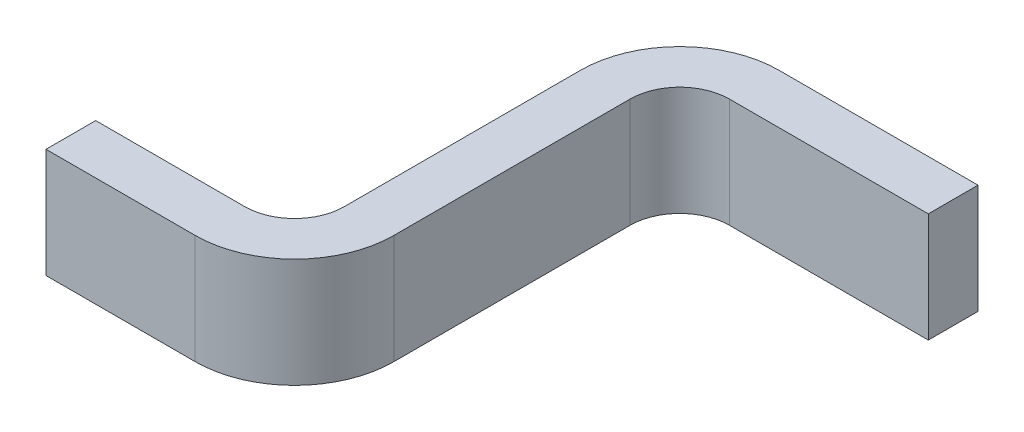
ISO-10303-21;
HEADER;
FILE_DESCRIPTION(('STEP AP214'),'2;1');
FILE_NAME('part.step','',(''),(''),'','','');
FILE_SCHEMA(('AUTOMOTIVE_DESIGN { 1 0 10303 214 1 1 1 1 }'));
ENDSEC;
DATA;
#1=APPLICATION_CONTEXT('core data for automotive mechanical design processes');
#2=APPLICATION_PROTOCOL_DEFINITION('international standard','automotive_design',2000,#1);
#3=PRODUCT_CONTEXT('',#1,'mechanical');
#4=PRODUCT('Part','Part','',(#3));
#5=PRODUCT_RELATED_PRODUCT_CATEGORY('part','',(#4));
#6=PRODUCT_DEFINITION_FORMATION('','',#4);
#7=PRODUCT_DEFINITION_CONTEXT('part definition',#1,'design');
#8=PRODUCT_DEFINITION('design','',#6,#7);
#9=PRODUCT_DEFINITION_SHAPE('','',#8);
#10=(LENGTH_UNIT() NAMED_UNIT(*) SI_UNIT(.MILLI.,.METRE.));
#11=(NAMED_UNIT(*) PLANE_ANGLE_UNIT() SI_UNIT($,.RADIAN.));
#12=(NAMED_UNIT(*) SI_UNIT($,.STERADIAN.) SOLID_ANGLE_UNIT());
#13=UNCERTAINTY_MEASURE_WITH_UNIT(LENGTH_MEASURE(1.E-05),#10,'distance_accuracy_value','');
#14=(GEOMETRIC_REPRESENTATION_CONTEXT(3) GLOBAL_UNCERTAINTY_ASSIGNED_CONTEXT((#13)) GLOBAL_UNIT_ASSIGNED_CONTEXT((#10,
#11,#12)) REPRESENTATION_CONTEXT('',''));
#15=CARTESIAN_POINT('',(0.,0.,0.));
#16=DIRECTION('',(0.,0.,1.));
#17=DIRECTION('',(1.,0.,0.));
#18=AXIS2_PLACEMENT_3D('',#15,#16,#17);
#19=CARTESIAN_POINT('',(3.9,1.36,0.675));
#20=DIRECTION('',(0.,-1.,0.));
#21=DIRECTION('',(0.,0.,-1.));
#22=AXIS2_PLACEMENT_3D('',#19,#20,#21);
#23=PLANE('',#22);
#24=CARTESIAN_POINT('',(3.8,1.36,0.675));
#25=DIRECTION('',(0.,-1.,0.));
#26=DIRECTION('',(0.,0.,-1.));
#27=AXIS2_PLACEMENT_3D('',#24,#25,#26);
#28=CIRCLE('',#27,0.1);
#29=CARTESIAN_POINT('',(3.9,1.36,0.675));
#30=VERTEX_POINT('',#29);
#31=CARTESIAN_POINT('',(3.8,1.36,0.775));
#32=VERTEX_POINT('',#31);
#33=EDGE_CURVE('E162',#30,#32,#28,.T.);
#34=ORIENTED_EDGE('',*,*,#33,.T.);
#35=DIRECTION('',(1.,0.,0.));
#36=VECTOR('',#35,1.);
#37=CARTESIAN_POINT('',(3.5,1.36,0.775));
#38=LINE('',#37,#36);
#39=CARTESIAN_POINT('',(3.5,1.36,0.775));
#40=VERTEX_POINT('',#39);
#41=EDGE_CURVE('E120',#32,#40,#38,.F.);
#42=ORIENTED_EDGE('',*,*,#41,.T.);
#43=DIRECTION('',(0.,0.,1.));
#44=VECTOR('',#43,1.);
#45=CARTESIAN_POINT('',(3.5,1.36,0.775));
#46=LINE('',#45,#44);
#47=CARTESIAN_POINT('',(3.5,1.36,0.875));
#48=VERTEX_POINT('',#47);
#49=EDGE_CURVE('E116',#48,#40,#46,.F.);
#50=ORIENTED_EDGE('',*,*,#49,.F.);
#51=DIRECTION('',(-1.,0.,0.));
#52=VECTOR('',#51,1.);
#53=CARTESIAN_POINT('',(3.5,1.36,0.875));
#54=LINE('',#53,#52);
#55=CARTESIAN_POINT('',(3.8,1.36,0.875));
#56=VERTEX_POINT('',#55);
#57=EDGE_CURVE('E111',#48,#56,#54,.F.);
#58=ORIENTED_EDGE('',*,*,#57,.T.);
#59=CARTESIAN_POINT('',(3.8,1.36,0.675));
#60=DIRECTION('',(0.,-1.,0.));
#61=DIRECTION('',(0.,0.,-1.));
#62=AXIS2_PLACEMENT_3D('',#59,#60,#61);
#63=CIRCLE('',#62,0.2);
#64=CARTESIAN_POINT('',(4.,1.36,0.675));
#65=VERTEX_POINT('',#64);
#66=EDGE_CURVE('E102',#65,#56,#63,.T.);
#67=ORIENTED_EDGE('',*,*,#66,.F.);
#68=DIRECTION('',(0.,0.,1.));
#69=VECTOR('',#68,1.);
#70=CARTESIAN_POINT('',(4.,1.36,0.675));
#71=LINE('',#70,#69);
#72=CARTESIAN_POINT('',(4.,1.36,0.2));
#73=VERTEX_POINT('',#72);
#74=EDGE_CURVE('E98',#65,#73,#71,.F.);
#75=ORIENTED_EDGE('',*,*,#74,.T.);
#76=CARTESIAN_POINT('',(4.1,1.36,0.2));
#77=DIRECTION('',(0.,1.,0.));
#78=DIRECTION('',(0.,0.,1.));
#79=AXIS2_PLACEMENT_3D('',#76,#77,#78);
#80=CIRCLE('',#79,0.1);
#81=CARTESIAN_POINT('',(4.1,1.36,0.1));
#82=VERTEX_POINT('',#81);
#83=EDGE_CURVE('E20',#73,#82,#80,.F.);
#84=ORIENTED_EDGE('',*,*,#83,.T.);
#85=DIRECTION('',(-1.,0.,0.));
#86=VECTOR('',#85,1.);
#87=CARTESIAN_POINT('',(4.1,1.36,0.1));
#88=LINE('',#87,#86);
#89=CARTESIAN_POINT('',(4.5,1.36,0.1));
#90=VERTEX_POINT('',#89);
#91=EDGE_CURVE('E145',#82,#90,#88,.F.);
#92=ORIENTED_EDGE('',*,*,#91,.T.);
#93=DIRECTION('',(0.,0.,1.));
#94=VECTOR('',#93,1.);
#95=CARTESIAN_POINT('',(4.5,1.36,0.));
#96=LINE('',#95,#94);
#97=CARTESIAN_POINT('',(4.5,1.36,0.));
#98=VERTEX_POINT('',#97);
#99=EDGE_CURVE('E139',#90,#98,#96,.F.);
#100=ORIENTED_EDGE('',*,*,#99,.T.);
#101=DIRECTION('',(1.,0.,0.));
#102=VECTOR('',#101,1.);
#103=CARTESIAN_POINT('',(4.1,1.36,0.));
#104=LINE('',#103,#102);
#105=CARTESIAN_POINT('',(4.1,1.36,0.));
#106=VERTEX_POINT('',#105);
#107=EDGE_CURVE('E132',#98,#106,#104,.F.);
#108=ORIENTED_EDGE('',*,*,#107,.T.);
#109=CARTESIAN_POINT('',(4.1,1.36,0.2));
#110=DIRECTION('',(0.,1.,0.));
#111=DIRECTION('',(0.,0.,1.));
#112=AXIS2_PLACEMENT_3D('',#109,#110,#111);
#113=CIRCLE('',#112,0.2);
#114=CARTESIAN_POINT('',(3.9,1.36,0.2));
#115=VERTEX_POINT('',#114);
#116=EDGE_CURVE('E135',#115,#106,#113,.F.);
#117=ORIENTED_EDGE('',*,*,#116,.F.);
#118=DIRECTION('',(0.,0.,-1.));
#119=VECTOR('',#118,1.);
#120=CARTESIAN_POINT('',(3.9,1.36,0.675));
#121=LINE('',#120,#119);
#122=EDGE_CURVE('E128',#115,#30,#121,.F.);
#123=ORIENTED_EDGE('',*,*,#122,.T.);
#124=EDGE_LOOP('',(#34,#42,#50,#58,#67,#75,#84,#92,#100,#108,#117,#123));
#125=FACE_BOUND('',#124,.T.);
#126=ADVANCED_FACE('F17',(#125),#23,.F.);
#127=CARTESIAN_POINT('',(4.1,1.36,0.2));
#128=DIRECTION('',(0.,1.,0.));
#129=DIRECTION('',(0.,0.,1.));
#130=AXIS2_PLACEMENT_3D('',#127,#128,#129);
#131=CYLINDRICAL_SURFACE('',#130,0.1);
#132=DIRECTION('',(0.,1.,0.));
#133=VECTOR('',#132,1.);
#134=CARTESIAN_POINT('',(4.,1.36,0.2));
#135=LINE('',#134,#133);
#136=CARTESIAN_POINT('',(4.,1.14,0.2));
#137=VERTEX_POINT('',#136);
#138=EDGE_CURVE('E91',#73,#137,#135,.F.);
#139=ORIENTED_EDGE('',*,*,#138,.T.);
#140=CARTESIAN_POINT('',(4.1,1.14,0.2));
#141=DIRECTION('',(0.,1.,0.));
#142=DIRECTION('',(0.,0.,1.));
#143=AXIS2_PLACEMENT_3D('',#140,#141,#142);
#144=CIRCLE('',#143,0.1);
#145=CARTESIAN_POINT('',(4.1,1.14,0.1));
#146=VERTEX_POINT('',#145);
#147=EDGE_CURVE('E103',#137,#146,#144,.F.);
#148=ORIENTED_EDGE('',*,*,#147,.T.);
#149=DIRECTION('',(0.,1.,0.));
#150=VECTOR('',#149,1.);
#151=CARTESIAN_POINT('',(4.1,1.36,0.1));
#152=LINE('',#151,#150);
#153=EDGE_CURVE('E92',#146,#82,#152,.T.);
#154=ORIENTED_EDGE('',*,*,#153,.T.);
#155=ORIENTED_EDGE('',*,*,#83,.F.);
#156=EDGE_LOOP('',(#139,#148,#154,#155));
#157=FACE_BOUND('',#156,.T.);
#158=ADVANCED_FACE('F89',(#157),#131,.F.);
#159=CARTESIAN_POINT('',(4.1,1.36,0.1));
#160=DIRECTION('',(0.,0.,-1.));
#161=DIRECTION('',(-1.,0.,0.));
#162=AXIS2_PLACEMENT_3D('',#159,#160,#161);
#163=PLANE('',#162);
#164=ORIENTED_EDGE('',*,*,#153,.F.);
#165=DIRECTION('',(1.,0.,0.));
#166=VECTOR('',#165,1.);
#167=CARTESIAN_POINT('',(4.,1.14,0.1));
#168=LINE('',#167,#166);
#169=CARTESIAN_POINT('',(4.5,1.14,0.1));
#170=VERTEX_POINT('',#169);
#171=EDGE_CURVE('E105',#146,#170,#168,.T.);
#172=ORIENTED_EDGE('',*,*,#171,.T.);
#173=DIRECTION('',(0.,1.,0.));
#174=VECTOR('',#173,1.);
#175=CARTESIAN_POINT('',(4.5,1.14,0.1));
#176=LINE('',#175,#174);
#177=EDGE_CURVE('E142',#170,#90,#176,.T.);
#178=ORIENTED_EDGE('',*,*,#177,.T.);
#179=ORIENTED_EDGE('',*,*,#91,.F.);
#180=EDGE_LOOP('',(#164,#172,#178,#179));
#181=FACE_BOUND('',#180,.T.);
#182=ADVANCED_FACE('F187',(#181),#163,.F.);
#183=CARTESIAN_POINT('',(4.5,1.14,0.));
#184=DIRECTION('',(-1.,0.,0.));
#185=DIRECTION('',(0.,0.,1.));
#186=AXIS2_PLACEMENT_3D('',#183,#184,#185);
#187=PLANE('',#186);
#188=ORIENTED_EDGE('',*,*,#177,.F.);
#189=DIRECTION('',(0.,0.,1.));
#190=VECTOR('',#189,1.);
#191=CARTESIAN_POINT('',(4.5,1.14,0.675));
#192=LINE('',#191,#190);
#193=CARTESIAN_POINT('',(4.5,1.14,0.));
#194=VERTEX_POINT('',#193);
#195=EDGE_CURVE('E176',#170,#194,#192,.F.);
#196=ORIENTED_EDGE('',*,*,#195,.T.);
#197=DIRECTION('',(0.,1.,0.));
#198=VECTOR('',#197,1.);
#199=CARTESIAN_POINT('',(4.5,1.14,0.));
#200=LINE('',#199,#198);
#201=EDGE_CURVE('E136',#194,#98,#200,.T.);
#202=ORIENTED_EDGE('',*,*,#201,.T.);
#203=ORIENTED_EDGE('',*,*,#99,.F.);
#204=EDGE_LOOP('',(#188,#196,#202,#203));
#205=FACE_BOUND('',#204,.T.);
#206=ADVANCED_FACE('F192',(#205),#187,.F.);
#207=CARTESIAN_POINT('',(4.1,1.14,0.));
#208=DIRECTION('',(0.,0.,1.));
#209=DIRECTION('',(1.,0.,0.));
#210=AXIS2_PLACEMENT_3D('',#207,#208,#209);
#211=PLANE('',#210);
#212=DIRECTION('',(0.,1.,0.));
#213=VECTOR('',#212,1.);
#214=CARTESIAN_POINT('',(4.1,1.14,0.));
#215=LINE('',#214,#213);
#216=CARTESIAN_POINT('',(4.1,1.14,0.));
#217=VERTEX_POINT('',#216);
#218=EDGE_CURVE('E163',#106,#217,#215,.F.);
#219=ORIENTED_EDGE('',*,*,#218,.F.);
#220=ORIENTED_EDGE('',*,*,#107,.F.);
#221=ORIENTED_EDGE('',*,*,#201,.F.);
#222=DIRECTION('',(1.,0.,0.));
#223=VECTOR('',#222,1.);
#224=CARTESIAN_POINT('',(4.,1.14,0.));
#225=LINE('',#224,#223);
#226=EDGE_CURVE('E159',#194,#217,#225,.F.);
#227=ORIENTED_EDGE('',*,*,#226,.T.);
#228=EDGE_LOOP('',(#219,#220,#221,#227));
#229=FACE_BOUND('',#228,.T.);
#230=ADVANCED_FACE('F264',(#229),#211,.F.);
#231=CARTESIAN_POINT('',(4.1,1.14,0.2));
#232=DIRECTION('',(0.,1.,0.));
#233=DIRECTION('',(0.,0.,1.));
#234=AXIS2_PLACEMENT_3D('',#231,#232,#233);
#235=CYLINDRICAL_SURFACE('',#234,0.2);
#236=ORIENTED_EDGE('',*,*,#116,.T.);
#237=ORIENTED_EDGE('',*,*,#218,.T.);
#238=CARTESIAN_POINT('',(4.1,1.14,0.2));
#239=DIRECTION('',(0.,1.,0.));
#240=DIRECTION('',(0.,0.,1.));
#241=AXIS2_PLACEMENT_3D('',#238,#239,#240);
#242=CIRCLE('',#241,0.2);
#243=CARTESIAN_POINT('',(3.9,1.14,0.2));
#244=VERTEX_POINT('',#243);
#245=EDGE_CURVE('E157',#217,#244,#242,.T.);
#246=ORIENTED_EDGE('',*,*,#245,.T.);
#247=DIRECTION('',(0.,1.,0.));
#248=VECTOR('',#247,1.);
#249=CARTESIAN_POINT('',(3.9,1.14,0.2));
#250=LINE('',#249,#248);
#251=EDGE_CURVE('E131',#244,#115,#250,.T.);
#252=ORIENTED_EDGE('',*,*,#251,.T.);
#253=EDGE_LOOP('',(#236,#237,#246,#252));
#254=FACE_BOUND('',#253,.T.);
#255=ADVANCED_FACE('F266',(#254),#235,.T.);
#256=CARTESIAN_POINT('',(3.9,1.14,0.675));
#257=DIRECTION('',(1.,0.,0.));
#258=DIRECTION('',(0.,0.,-1.));
#259=AXIS2_PLACEMENT_3D('',#256,#257,#258);
#260=PLANE('',#259);
#261=DIRECTION('',(0.,-1.,0.));
#262=VECTOR('',#261,1.);
#263=CARTESIAN_POINT('',(3.9,1.14,0.675));
#264=LINE('',#263,#262);
#265=CARTESIAN_POINT('',(3.9,1.14,0.675));
#266=VERTEX_POINT('',#265);
#267=EDGE_CURVE('E130',#266,#30,#264,.F.);
#268=ORIENTED_EDGE('',*,*,#267,.T.);
#269=ORIENTED_EDGE('',*,*,#122,.F.);
#270=ORIENTED_EDGE('',*,*,#251,.F.);
#271=DIRECTION('',(0.,0.,1.));
#272=VECTOR('',#271,1.);
#273=CARTESIAN_POINT('',(3.9,1.14,0.675));
#274=LINE('',#273,#272);
#275=EDGE_CURVE('E156',#244,#266,#274,.T.);
#276=ORIENTED_EDGE('',*,*,#275,.T.);
#277=EDGE_LOOP('',(#268,#269,#270,#276));
#278=FACE_BOUND('',#277,.T.);
#279=ADVANCED_FACE('F231',(#278),#260,.F.);
#280=CARTESIAN_POINT('',(3.80000000000001,1.14,0.675));
#281=DIRECTION('',(0.,-1.,0.));
#282=DIRECTION('',(0.,0.,-1.));
#283=AXIS2_PLACEMENT_3D('',#280,#281,#282);
#284=CYLINDRICAL_SURFACE('',#283,0.1);
#285=DIRECTION('',(0.,1.,0.));
#286=VECTOR('',#285,1.);
#287=CARTESIAN_POINT('',(3.80000000000001,1.14,0.775));
#288=LINE('',#287,#286);
#289=CARTESIAN_POINT('',(3.80000000000001,1.14,0.775));
#290=VERTEX_POINT('',#289);
#291=EDGE_CURVE('E125',#290,#32,#288,.T.);
#292=ORIENTED_EDGE('',*,*,#291,.T.);
#293=ORIENTED_EDGE('',*,*,#33,.F.);
#294=ORIENTED_EDGE('',*,*,#267,.F.);
#295=CARTESIAN_POINT('',(3.80000000000001,1.14,0.675));
#296=DIRECTION('',(0.,-1.,0.));
#297=DIRECTION('',(0.,0.,-1.));
#298=AXIS2_PLACEMENT_3D('',#295,#296,#297);
#299=CIRCLE('',#298,0.1);
#300=EDGE_CURVE('E152',#266,#290,#299,.T.);
#301=ORIENTED_EDGE('',*,*,#300,.T.);
#302=EDGE_LOOP('',(#292,#293,#294,#301));
#303=FACE_BOUND('',#302,.T.);
#304=ADVANCED_FACE('F235',(#303),#284,.F.);
#305=CARTESIAN_POINT('',(3.5,1.14,0.775));
#306=DIRECTION('',(0.,0.,1.));
#307=DIRECTION('',(1.,0.,0.));
#308=AXIS2_PLACEMENT_3D('',#305,#306,#307);
#309=PLANE('',#308);
#310=DIRECTION('',(0.,1.,0.));
#311=VECTOR('',#310,1.);
#312=CARTESIAN_POINT('',(3.5,1.14,0.775));
#313=LINE('',#312,#311);
#314=CARTESIAN_POINT('',(3.5,1.14,0.775));
#315=VERTEX_POINT('',#314);
#316=EDGE_CURVE('E119',#40,#315,#313,.F.);
#317=ORIENTED_EDGE('',*,*,#316,.F.);
#318=ORIENTED_EDGE('',*,*,#41,.F.);
#319=ORIENTED_EDGE('',*,*,#291,.F.);
#320=DIRECTION('',(1.,0.,0.));
#321=VECTOR('',#320,1.);
#322=CARTESIAN_POINT('',(4.,1.14,0.775));
#323=LINE('',#322,#321);
#324=EDGE_CURVE('E155',#290,#315,#323,.F.);
#325=ORIENTED_EDGE('',*,*,#324,.T.);
#326=EDGE_LOOP('',(#317,#318,#319,#325));
#327=FACE_BOUND('',#326,.T.);
#328=ADVANCED_FACE('F259',(#327),#309,.F.);
#329=CARTESIAN_POINT('',(3.5,1.14,0.775));
#330=DIRECTION('',(-1.,0.,0.));
#331=DIRECTION('',(0.,0.,1.));
#332=AXIS2_PLACEMENT_3D('',#329,#330,#331);
#333=PLANE('',#332);
#334=DIRECTION('',(0.,0.,1.));
#335=VECTOR('',#334,1.);
#336=CARTESIAN_POINT('',(3.5,1.14,0.675));
#337=LINE('',#336,#335);
#338=CARTESIAN_POINT('',(3.5,1.14,0.875));
#339=VERTEX_POINT('',#338);
#340=EDGE_CURVE('E217',#315,#339,#337,.T.);
#341=ORIENTED_EDGE('',*,*,#340,.T.);
#342=DIRECTION('',(0.,1.,0.));
#343=VECTOR('',#342,1.);
#344=CARTESIAN_POINT('',(3.5,1.36,0.875));
#345=LINE('',#344,#343);
#346=EDGE_CURVE('E113',#339,#48,#345,.T.);
#347=ORIENTED_EDGE('',*,*,#346,.T.);
#348=ORIENTED_EDGE('',*,*,#49,.T.);
#349=ORIENTED_EDGE('',*,*,#316,.T.);
#350=EDGE_LOOP('',(#341,#347,#348,#349));
#351=FACE_BOUND('',#350,.T.);
#352=ADVANCED_FACE('F255',(#351),#333,.T.);
#353=CARTESIAN_POINT('',(3.5,1.36,0.875));
#354=DIRECTION('',(0.,0.,-1.));
#355=DIRECTION('',(-1.,0.,0.));
#356=AXIS2_PLACEMENT_3D('',#353,#354,#355);
#357=PLANE('',#356);
#358=ORIENTED_EDGE('',*,*,#346,.F.);
#359=DIRECTION('',(1.,0.,0.));
#360=VECTOR('',#359,1.);
#361=CARTESIAN_POINT('',(4.,1.14,0.875));
#362=LINE('',#361,#360);
#363=CARTESIAN_POINT('',(3.80000000000001,1.14,0.875));
#364=VERTEX_POINT('',#363);
#365=EDGE_CURVE('E151',#339,#364,#362,.T.);
#366=ORIENTED_EDGE('',*,*,#365,.T.);
#367=DIRECTION('',(0.,-1.,0.));
#368=VECTOR('',#367,1.);
#369=CARTESIAN_POINT('',(3.8,1.36,0.875));
#370=LINE('',#369,#368);
#371=EDGE_CURVE('E99',#56,#364,#370,.T.);
#372=ORIENTED_EDGE('',*,*,#371,.F.);
#373=ORIENTED_EDGE('',*,*,#57,.F.);
#374=EDGE_LOOP('',(#358,#366,#372,#373));
#375=FACE_BOUND('',#374,.T.);
#376=ADVANCED_FACE('F251',(#375),#357,.F.);
#377=CARTESIAN_POINT('',(3.8,1.36,0.675));
#378=DIRECTION('',(0.,-1.,0.));
#379=DIRECTION('',(0.,0.,-1.));
#380=AXIS2_PLACEMENT_3D('',#377,#378,#379);
#381=CYLINDRICAL_SURFACE('',#380,0.2);
#382=CARTESIAN_POINT('',(3.80000000000001,1.14,0.675));
#383=DIRECTION('',(0.,-1.,0.));
#384=DIRECTION('',(0.,0.,-1.));
#385=AXIS2_PLACEMENT_3D('',#382,#383,#384);
#386=CIRCLE('',#385,0.2);
#387=CARTESIAN_POINT('',(4.,1.14,0.675));
#388=VERTEX_POINT('',#387);
#389=EDGE_CURVE('E26',#364,#388,#386,.F.);
#390=ORIENTED_EDGE('',*,*,#389,.T.);
#391=DIRECTION('',(0.,1.,0.));
#392=VECTOR('',#391,1.);
#393=CARTESIAN_POINT('',(4.,1.36,0.675));
#394=LINE('',#393,#392);
#395=EDGE_CURVE('E34',#388,#65,#394,.T.);
#396=ORIENTED_EDGE('',*,*,#395,.T.);
#397=ORIENTED_EDGE('',*,*,#66,.T.);
#398=ORIENTED_EDGE('',*,*,#371,.T.);
#399=EDGE_LOOP('',(#390,#396,#397,#398));
#400=FACE_BOUND('',#399,.T.);
#401=ADVANCED_FACE('F280',(#400),#381,.T.);
#402=CARTESIAN_POINT('',(4.,1.36,0.675));
#403=DIRECTION('',(-1.,0.,0.));
#404=DIRECTION('',(0.,0.,1.));
#405=AXIS2_PLACEMENT_3D('',#402,#403,#404);
#406=PLANE('',#405);
#407=ORIENTED_EDGE('',*,*,#395,.F.);
#408=DIRECTION('',(0.,0.,1.));
#409=VECTOR('',#408,1.);
#410=CARTESIAN_POINT('',(4.,1.14,0.675));
#411=LINE('',#410,#409);
#412=EDGE_CURVE('E11',#388,#137,#411,.F.);
#413=ORIENTED_EDGE('',*,*,#412,.T.);
#414=ORIENTED_EDGE('',*,*,#138,.F.);
#415=ORIENTED_EDGE('',*,*,#74,.F.);
#416=EDGE_LOOP('',(#407,#413,#414,#415));
#417=FACE_BOUND('',#416,.T.);
#418=ADVANCED_FACE('F97',(#417),#406,.F.);
#419=CARTESIAN_POINT('',(4.,1.14,0.675));
#420=DIRECTION('',(0.,1.,0.));
#421=DIRECTION('',(0.,0.,1.));
#422=AXIS2_PLACEMENT_3D('',#419,#420,#421);
#423=PLANE('',#422);
#424=ORIENTED_EDGE('',*,*,#389,.F.);
#425=ORIENTED_EDGE('',*,*,#365,.F.);
#426=ORIENTED_EDGE('',*,*,#340,.F.);
#427=ORIENTED_EDGE('',*,*,#324,.F.);
#428=ORIENTED_EDGE('',*,*,#300,.F.);
#429=ORIENTED_EDGE('',*,*,#275,.F.);
#430=ORIENTED_EDGE('',*,*,#245,.F.);
#431=ORIENTED_EDGE('',*,*,#226,.F.);
#432=ORIENTED_EDGE('',*,*,#195,.F.);
#433=ORIENTED_EDGE('',*,*,#171,.F.);
#434=ORIENTED_EDGE('',*,*,#147,.F.);
#435=ORIENTED_EDGE('',*,*,#412,.F.);
#436=EDGE_LOOP('',(#424,#425,#426,#427,#428,#429,#430,#431,#432,#433,#434,#435));
#437=FACE_BOUND('',#436,.T.);
#438=ADVANCED_FACE('F197',(#437),#423,.F.);
#439=CLOSED_SHELL('',(#126,#158,#182,#206,#230,#255,#279,#304,#328,#352,#376,#401,#418,#438));
#440=MANIFOLD_SOLID_BREP('B1',#439);
#441=ADVANCED_BREP_SHAPE_REPRESENTATION('',(#18,#440),#14);
#442=SHAPE_DEFINITION_REPRESENTATION(#9,#441);
ENDSEC;
END-ISO-10303-21;
